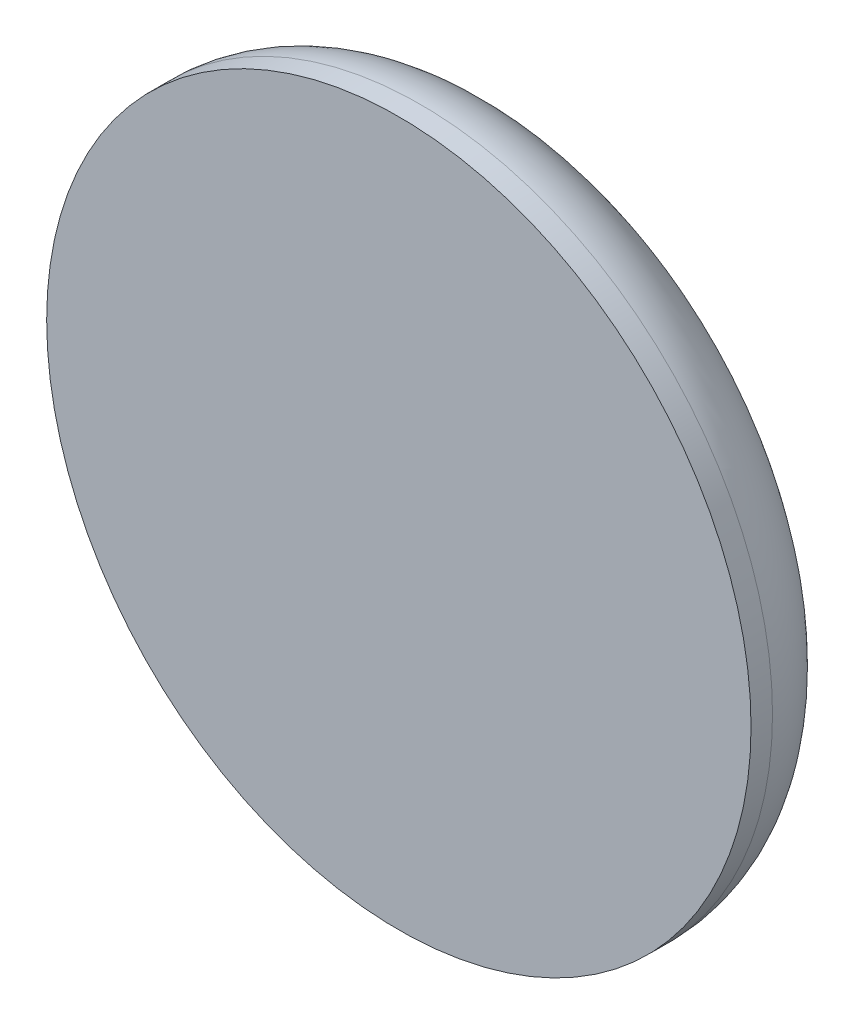
ISO-10303-21;
HEADER;
FILE_DESCRIPTION(('STEP AP214'),'2;1');
FILE_NAME('part.step','',(''),(''),'','','');
FILE_SCHEMA(('AUTOMOTIVE_DESIGN { 1 0 10303 214 1 1 1 1 }'));
ENDSEC;
DATA;
#1=APPLICATION_CONTEXT('core data for automotive mechanical design processes');
#2=APPLICATION_PROTOCOL_DEFINITION('international standard','automotive_design',2000,#1);
#3=PRODUCT_CONTEXT('',#1,'mechanical');
#4=PRODUCT('Part','Part','',(#3));
#5=PRODUCT_RELATED_PRODUCT_CATEGORY('part','',(#4));
#6=PRODUCT_DEFINITION_FORMATION('','',#4);
#7=PRODUCT_DEFINITION_CONTEXT('part definition',#1,'design');
#8=PRODUCT_DEFINITION('design','',#6,#7);
#9=PRODUCT_DEFINITION_SHAPE('','',#8);
#10=(LENGTH_UNIT() NAMED_UNIT(*) SI_UNIT(.MILLI.,.METRE.));
#11=(NAMED_UNIT(*) PLANE_ANGLE_UNIT() SI_UNIT($,.RADIAN.));
#12=(NAMED_UNIT(*) SI_UNIT($,.STERADIAN.) SOLID_ANGLE_UNIT());
#13=UNCERTAINTY_MEASURE_WITH_UNIT(LENGTH_MEASURE(1.E-05),#10,'distance_accuracy_value','');
#14=(GEOMETRIC_REPRESENTATION_CONTEXT(3) GLOBAL_UNCERTAINTY_ASSIGNED_CONTEXT((#13)) GLOBAL_UNIT_ASSIGNED_CONTEXT((#10,
#11,#12)) REPRESENTATION_CONTEXT('',''));
#15=CARTESIAN_POINT('',(0.,0.,0.));
#16=DIRECTION('',(0.,0.,1.));
#17=DIRECTION('',(1.,0.,0.));
#18=AXIS2_PLACEMENT_3D('',#15,#16,#17);
#19=CARTESIAN_POINT('',(0.,0.,1.753125));
#20=DIRECTION('',(0.,0.,1.));
#21=DIRECTION('',(1.,0.,0.));
#22=AXIS2_PLACEMENT_3D('',#19,#20,#21);
#23=SPHERICAL_SURFACE('',#22,2.003125);
#24=CARTESIAN_POINT('',(0.,0.,-0.183077555279449));
#25=DIRECTION('',(0.,0.,1.));
#26=DIRECTION('',(1.,0.,0.));
#27=AXIS2_PLACEMENT_3D('',#24,#25,#26);
#28=CIRCLE('',#27,0.513448566610456);
#29=CARTESIAN_POINT('',(0.513448566610456,0.,-0.183077555279449));
#30=VERTEX_POINT('',#29);
#31=EDGE_CURVE('E10',#30,#30,#28,.T.);
#32=ORIENTED_EDGE('',*,*,#31,.F.);
#33=EDGE_LOOP('',(#32));
#34=FACE_BOUND('',#33,.T.);
#35=ADVANCED_FACE('F32',(#34),#23,.T.);
#36=CARTESIAN_POINT('',(0.,0.,-0.0380889083942487));
#37=DIRECTION('',(0.,0.,1.));
#38=DIRECTION('',(1.,0.,0.));
#39=AXIS2_PLACEMENT_3D('',#36,#37,#38);
#40=TOROIDAL_SURFACE('',#39,0.475,0.15);
#41=ORIENTED_EDGE('',*,*,#31,.T.);
#42=EDGE_LOOP('',(#41));
#43=FACE_BOUND('',#42,.T.);
#44=CARTESIAN_POINT('',(0.,0.,-0.0380889083942491));
#45=DIRECTION('',(0.,0.,1.));
#46=DIRECTION('',(1.,0.,0.));
#47=AXIS2_PLACEMENT_3D('',#44,#45,#46);
#48=CIRCLE('',#47,0.625);
#49=CARTESIAN_POINT('',(0.625,0.,-0.0380889083942491));
#50=VERTEX_POINT('',#49);
#51=EDGE_CURVE('E38',#50,#50,#48,.T.);
#52=ORIENTED_EDGE('',*,*,#51,.F.);
#53=EDGE_LOOP('',(#52));
#54=FACE_BOUND('',#53,.T.);
#55=ADVANCED_FACE('F53',(#43,#54),#40,.T.);
#56=CARTESIAN_POINT('',(0.,0.,0.));
#57=DIRECTION('',(0.,0.,1.));
#58=DIRECTION('',(1.,0.,0.));
#59=AXIS2_PLACEMENT_3D('',#56,#57,#58);
#60=CYLINDRICAL_SURFACE('',#59,0.625000000000001);
#61=ORIENTED_EDGE('',*,*,#51,.T.);
#62=EDGE_LOOP('',(#61));
#63=FACE_BOUND('',#62,.T.);
#64=CARTESIAN_POINT('',(0.,0.,0.));
#65=DIRECTION('',(0.,0.,1.));
#66=DIRECTION('',(1.,0.,0.));
#67=AXIS2_PLACEMENT_3D('',#64,#65,#66);
#68=CIRCLE('',#67,0.625000000000001);
#69=CARTESIAN_POINT('',(0.625000000000001,0.,0.));
#70=VERTEX_POINT('',#69);
#71=EDGE_CURVE('E42',#70,#70,#68,.T.);
#72=ORIENTED_EDGE('',*,*,#71,.F.);
#73=EDGE_LOOP('',(#72));
#74=FACE_BOUND('',#73,.T.);
#75=ADVANCED_FACE('F51',(#63,#74),#60,.T.);
#76=CARTESIAN_POINT('',(0.,0.,0.));
#77=DIRECTION('',(0.,0.,1.));
#78=DIRECTION('',(1.,0.,0.));
#79=AXIS2_PLACEMENT_3D('',#76,#77,#78);
#80=PLANE('',#79);
#81=ORIENTED_EDGE('',*,*,#71,.T.);
#82=EDGE_LOOP('',(#81));
#83=FACE_BOUND('',#82,.T.);
#84=ADVANCED_FACE('F49',(#83),#80,.T.);
#85=CLOSED_SHELL('',(#35,#55,#75,#84));
#86=MANIFOLD_SOLID_BREP('B2',#85);
#87=ADVANCED_BREP_SHAPE_REPRESENTATION('',(#18,#86),#14);
#88=SHAPE_DEFINITION_REPRESENTATION(#9,#87);
ENDSEC;
END-ISO-10303-21;
